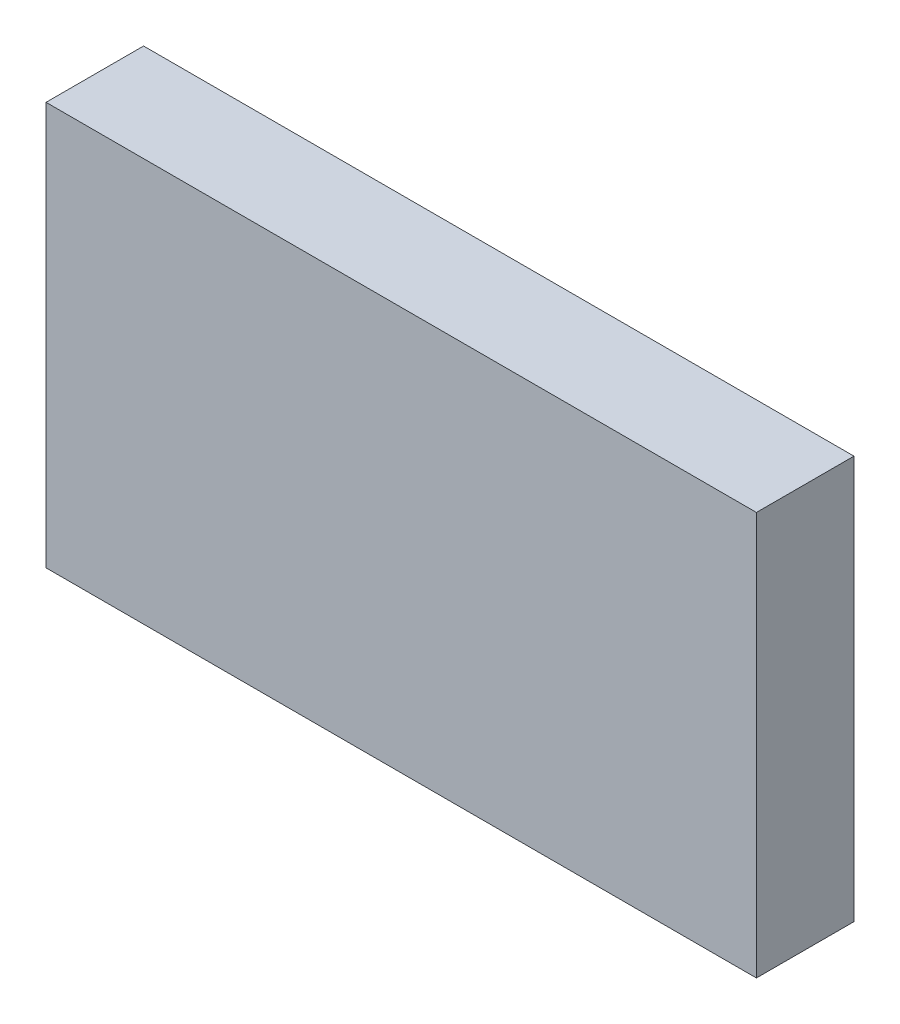
ISO-10303-21;
HEADER;
FILE_DESCRIPTION(('STEP AP214'),'2;1');
FILE_NAME('part.step','',(''),(''),'','','');
FILE_SCHEMA(('AUTOMOTIVE_DESIGN { 1 0 10303 214 1 1 1 1 }'));
ENDSEC;
DATA;
#1=APPLICATION_CONTEXT('core data for automotive mechanical design processes');
#2=APPLICATION_PROTOCOL_DEFINITION('international standard','automotive_design',2000,#1);
#3=PRODUCT_CONTEXT('',#1,'mechanical');
#4=PRODUCT('Part','Part','',(#3));
#5=PRODUCT_RELATED_PRODUCT_CATEGORY('part','',(#4));
#6=PRODUCT_DEFINITION_FORMATION('','',#4);
#7=PRODUCT_DEFINITION_CONTEXT('part definition',#1,'design');
#8=PRODUCT_DEFINITION('design','',#6,#7);
#9=PRODUCT_DEFINITION_SHAPE('','',#8);
#10=(LENGTH_UNIT() NAMED_UNIT(*) SI_UNIT(.MILLI.,.METRE.));
#11=(NAMED_UNIT(*) PLANE_ANGLE_UNIT() SI_UNIT($,.RADIAN.));
#12=(NAMED_UNIT(*) SI_UNIT($,.STERADIAN.) SOLID_ANGLE_UNIT());
#13=UNCERTAINTY_MEASURE_WITH_UNIT(LENGTH_MEASURE(1.E-05),#10,'distance_accuracy_value','');
#14=(GEOMETRIC_REPRESENTATION_CONTEXT(3) GLOBAL_UNCERTAINTY_ASSIGNED_CONTEXT((#13)) GLOBAL_UNIT_ASSIGNED_CONTEXT((#10,
#11,#12)) REPRESENTATION_CONTEXT('',''));
#15=CARTESIAN_POINT('',(0.,0.,0.));
#16=DIRECTION('',(0.,0.,1.));
#17=DIRECTION('',(1.,0.,0.));
#18=AXIS2_PLACEMENT_3D('',#15,#16,#17);
#19=CARTESIAN_POINT('',(-0.92499942,0.52500022,0.));
#20=DIRECTION('',(1.,0.,0.));
#21=DIRECTION('',(0.,-1.,0.));
#22=AXIS2_PLACEMENT_3D('',#19,#20,#21);
#23=PLANE('',#22);
#24=DIRECTION('',(0.,-1.,0.));
#25=VECTOR('',#24,1.);
#26=CARTESIAN_POINT('',(-0.92499942,0.52500022,0.));
#27=LINE('',#26,#25);
#28=CARTESIAN_POINT('',(-0.92499942,0.52500022,0.));
#29=VERTEX_POINT('',#28);
#30=CARTESIAN_POINT('',(-0.92499942,-0.52500022,0.));
#31=VERTEX_POINT('',#30);
#32=EDGE_CURVE('E11',#29,#31,#27,.T.);
#33=ORIENTED_EDGE('',*,*,#32,.T.);
#34=DIRECTION('',(0.,0.,1.));
#35=VECTOR('',#34,1.);
#36=CARTESIAN_POINT('',(-0.92499942,-0.52500022,0.));
#37=LINE('',#36,#35);
#38=CARTESIAN_POINT('',(-0.92499942,-0.52500022,0.254));
#39=VERTEX_POINT('',#38);
#40=EDGE_CURVE('E24',#31,#39,#37,.T.);
#41=ORIENTED_EDGE('',*,*,#40,.T.);
#42=DIRECTION('',(0.,-1.,0.));
#43=VECTOR('',#42,1.);
#44=CARTESIAN_POINT('',(-0.92499942,0.52500022,0.254));
#45=LINE('',#44,#43);
#46=CARTESIAN_POINT('',(-0.92499942,0.52500022,0.254));
#47=VERTEX_POINT('',#46);
#48=EDGE_CURVE('E87',#47,#39,#45,.T.);
#49=ORIENTED_EDGE('',*,*,#48,.F.);
#50=DIRECTION('',(0.,0.,1.));
#51=VECTOR('',#50,1.);
#52=CARTESIAN_POINT('',(-0.92499942,0.52500022,0.));
#53=LINE('',#52,#51);
#54=EDGE_CURVE('E36',#29,#47,#53,.T.);
#55=ORIENTED_EDGE('',*,*,#54,.F.);
#56=EDGE_LOOP('',(#33,#41,#49,#55));
#57=FACE_BOUND('',#56,.T.);
#58=ADVANCED_FACE('F17',(#57),#23,.F.);
#59=CARTESIAN_POINT('',(-0.92499942,-0.52500022,0.));
#60=DIRECTION('',(0.,1.,0.));
#61=DIRECTION('',(1.,0.,0.));
#62=AXIS2_PLACEMENT_3D('',#59,#60,#61);
#63=PLANE('',#62);
#64=DIRECTION('',(1.,0.,0.));
#65=VECTOR('',#64,1.);
#66=CARTESIAN_POINT('',(-0.92499942,-0.52500022,0.));
#67=LINE('',#66,#65);
#68=CARTESIAN_POINT('',(0.92500196,-0.52500022,0.));
#69=VERTEX_POINT('',#68);
#70=EDGE_CURVE('E84',#31,#69,#67,.T.);
#71=ORIENTED_EDGE('',*,*,#70,.T.);
#72=DIRECTION('',(0.,0.,1.));
#73=VECTOR('',#72,1.);
#74=CARTESIAN_POINT('',(0.92500196,-0.52500022,0.));
#75=LINE('',#74,#73);
#76=CARTESIAN_POINT('',(0.92500196,-0.52500022,0.254));
#77=VERTEX_POINT('',#76);
#78=EDGE_CURVE('E82',#69,#77,#75,.T.);
#79=ORIENTED_EDGE('',*,*,#78,.T.);
#80=DIRECTION('',(1.,0.,0.));
#81=VECTOR('',#80,1.);
#82=CARTESIAN_POINT('',(-0.92499942,-0.52500022,0.254));
#83=LINE('',#82,#81);
#84=EDGE_CURVE('E62',#39,#77,#83,.T.);
#85=ORIENTED_EDGE('',*,*,#84,.F.);
#86=ORIENTED_EDGE('',*,*,#40,.F.);
#87=EDGE_LOOP('',(#71,#79,#85,#86));
#88=FACE_BOUND('',#87,.T.);
#89=ADVANCED_FACE('F89',(#88),#63,.F.);
#90=CARTESIAN_POINT('',(0.92500196,-0.52500022,0.));
#91=DIRECTION('',(-1.,0.,0.));
#92=DIRECTION('',(0.,1.,0.));
#93=AXIS2_PLACEMENT_3D('',#90,#91,#92);
#94=PLANE('',#93);
#95=DIRECTION('',(0.,1.,0.));
#96=VECTOR('',#95,1.);
#97=CARTESIAN_POINT('',(0.92500196,-0.52500022,0.));
#98=LINE('',#97,#96);
#99=CARTESIAN_POINT('',(0.92500196,0.52500022,0.));
#100=VERTEX_POINT('',#99);
#101=EDGE_CURVE('E71',#69,#100,#98,.T.);
#102=ORIENTED_EDGE('',*,*,#101,.T.);
#103=DIRECTION('',(0.,0.,1.));
#104=VECTOR('',#103,1.);
#105=CARTESIAN_POINT('',(0.92500196,0.52500022,0.));
#106=LINE('',#105,#104);
#107=CARTESIAN_POINT('',(0.92500196,0.52500022,0.254));
#108=VERTEX_POINT('',#107);
#109=EDGE_CURVE('E65',#100,#108,#106,.T.);
#110=ORIENTED_EDGE('',*,*,#109,.T.);
#111=DIRECTION('',(0.,1.,0.));
#112=VECTOR('',#111,1.);
#113=CARTESIAN_POINT('',(0.92500196,-0.52500022,0.254));
#114=LINE('',#113,#112);
#115=EDGE_CURVE('E57',#77,#108,#114,.T.);
#116=ORIENTED_EDGE('',*,*,#115,.F.);
#117=ORIENTED_EDGE('',*,*,#78,.F.);
#118=EDGE_LOOP('',(#102,#110,#116,#117));
#119=FACE_BOUND('',#118,.T.);
#120=ADVANCED_FACE('F69',(#119),#94,.F.);
#121=CARTESIAN_POINT('',(0.92500196,0.52500022,0.));
#122=DIRECTION('',(0.,-1.,0.));
#123=DIRECTION('',(-1.,0.,0.));
#124=AXIS2_PLACEMENT_3D('',#121,#122,#123);
#125=PLANE('',#124);
#126=DIRECTION('',(-1.,0.,0.));
#127=VECTOR('',#126,1.);
#128=CARTESIAN_POINT('',(0.92500196,0.52500022,0.));
#129=LINE('',#128,#127);
#130=EDGE_CURVE('E66',#100,#29,#129,.T.);
#131=ORIENTED_EDGE('',*,*,#130,.T.);
#132=ORIENTED_EDGE('',*,*,#54,.T.);
#133=DIRECTION('',(-1.,0.,0.));
#134=VECTOR('',#133,1.);
#135=CARTESIAN_POINT('',(0.92500196,0.52500022,0.254));
#136=LINE('',#135,#134);
#137=EDGE_CURVE('E61',#108,#47,#136,.T.);
#138=ORIENTED_EDGE('',*,*,#137,.F.);
#139=ORIENTED_EDGE('',*,*,#109,.F.);
#140=EDGE_LOOP('',(#131,#132,#138,#139));
#141=FACE_BOUND('',#140,.T.);
#142=ADVANCED_FACE('F76',(#141),#125,.F.);
#143=CARTESIAN_POINT('',(-0.92499942,0.52500022,0.));
#144=DIRECTION('',(0.,0.,-1.));
#145=DIRECTION('',(-1.,0.,0.));
#146=AXIS2_PLACEMENT_3D('',#143,#144,#145);
#147=PLANE('',#146);
#148=ORIENTED_EDGE('',*,*,#130,.F.);
#149=ORIENTED_EDGE('',*,*,#101,.F.);
#150=ORIENTED_EDGE('',*,*,#70,.F.);
#151=ORIENTED_EDGE('',*,*,#32,.F.);
#152=EDGE_LOOP('',(#148,#149,#150,#151));
#153=FACE_BOUND('',#152,.T.);
#154=ADVANCED_FACE('F91',(#153),#147,.T.);
#155=CARTESIAN_POINT('',(-0.92499942,0.52500022,0.254));
#156=DIRECTION('',(0.,0.,-1.));
#157=DIRECTION('',(-1.,0.,0.));
#158=AXIS2_PLACEMENT_3D('',#155,#156,#157);
#159=PLANE('',#158);
#160=ORIENTED_EDGE('',*,*,#48,.T.);
#161=ORIENTED_EDGE('',*,*,#84,.T.);
#162=ORIENTED_EDGE('',*,*,#115,.T.);
#163=ORIENTED_EDGE('',*,*,#137,.T.);
#164=EDGE_LOOP('',(#160,#161,#162,#163));
#165=FACE_BOUND('',#164,.T.);
#166=ADVANCED_FACE('F59',(#165),#159,.F.);
#167=CLOSED_SHELL('',(#58,#89,#120,#142,#154,#166));
#168=MANIFOLD_SOLID_BREP('B1',#167);
#169=ADVANCED_BREP_SHAPE_REPRESENTATION('',(#18,#168),#14);
#170=SHAPE_DEFINITION_REPRESENTATION(#9,#169);
ENDSEC;
END-ISO-10303-21;
